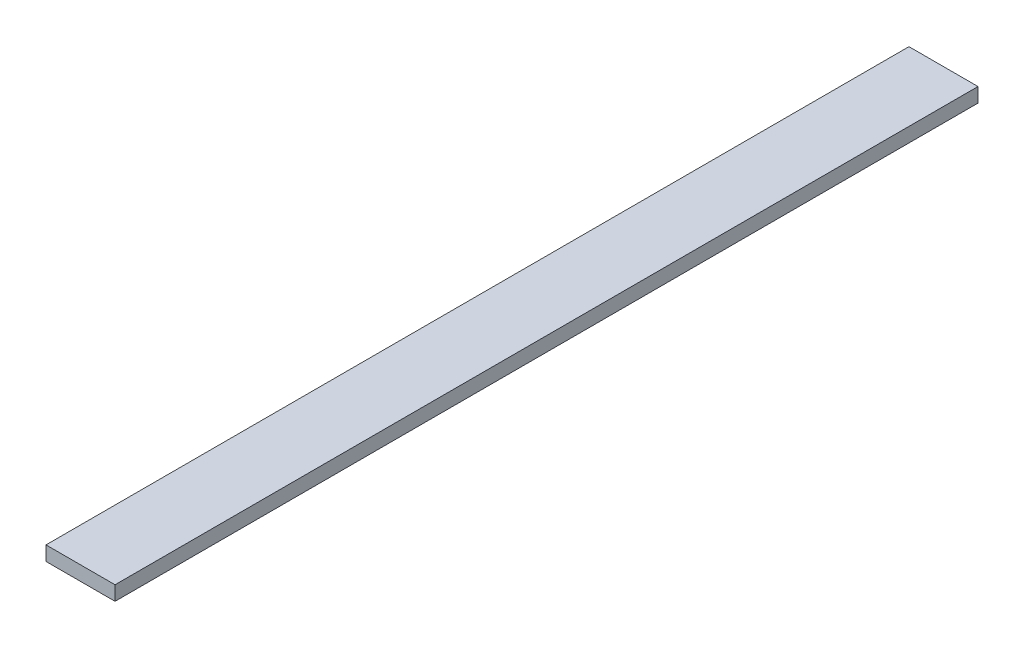
ISO-10303-21;
HEADER;
FILE_DESCRIPTION(('STEP AP214'),'2;1');
FILE_NAME('part.step','',(''),(''),'','','');
FILE_SCHEMA(('AUTOMOTIVE_DESIGN { 1 0 10303 214 1 1 1 1 }'));
ENDSEC;
DATA;
#1=APPLICATION_CONTEXT('core data for automotive mechanical design processes');
#2=APPLICATION_PROTOCOL_DEFINITION('international standard','automotive_design',2000,#1);
#3=PRODUCT_CONTEXT('',#1,'mechanical');
#4=PRODUCT('Part','Part','',(#3));
#5=PRODUCT_RELATED_PRODUCT_CATEGORY('part','',(#4));
#6=PRODUCT_DEFINITION_FORMATION('','',#4);
#7=PRODUCT_DEFINITION_CONTEXT('part definition',#1,'design');
#8=PRODUCT_DEFINITION('design','',#6,#7);
#9=PRODUCT_DEFINITION_SHAPE('','',#8);
#10=(LENGTH_UNIT() NAMED_UNIT(*) SI_UNIT(.MILLI.,.METRE.));
#11=(NAMED_UNIT(*) PLANE_ANGLE_UNIT() SI_UNIT($,.RADIAN.));
#12=(NAMED_UNIT(*) SI_UNIT($,.STERADIAN.) SOLID_ANGLE_UNIT());
#13=UNCERTAINTY_MEASURE_WITH_UNIT(LENGTH_MEASURE(1.E-05),#10,'distance_accuracy_value','');
#14=(GEOMETRIC_REPRESENTATION_CONTEXT(3) GLOBAL_UNCERTAINTY_ASSIGNED_CONTEXT((#13)) GLOBAL_UNIT_ASSIGNED_CONTEXT((#10,
#11,#12)) REPRESENTATION_CONTEXT('',''));
#15=CARTESIAN_POINT('',(0.,0.,0.));
#16=DIRECTION('',(0.,0.,1.));
#17=DIRECTION('',(1.,0.,0.));
#18=AXIS2_PLACEMENT_3D('',#15,#16,#17);
#19=CARTESIAN_POINT('',(24.,5.,0.));
#20=DIRECTION('',(0.,1.,0.));
#21=DIRECTION('',(0.,0.,1.));
#22=AXIS2_PLACEMENT_3D('',#19,#20,#21);
#23=PLANE('',#22);
#24=DIRECTION('',(1.,0.,0.));
#25=VECTOR('',#24,1.);
#26=CARTESIAN_POINT('',(0.,5.,600.));
#27=LINE('',#26,#25);
#28=CARTESIAN_POINT('',(24.,5.,600.));
#29=VERTEX_POINT('',#28);
#30=CARTESIAN_POINT('',(-24.,5.,600.));
#31=VERTEX_POINT('',#30);
#32=EDGE_CURVE('E55',#29,#31,#27,.F.);
#33=ORIENTED_EDGE('',*,*,#32,.F.);
#34=DIRECTION('',(0.,0.,-1.));
#35=VECTOR('',#34,1.);
#36=CARTESIAN_POINT('',(24.,5.,0.));
#37=LINE('',#36,#35);
#38=CARTESIAN_POINT('',(24.,5.,0.));
#39=VERTEX_POINT('',#38);
#40=EDGE_CURVE('E67',#39,#29,#37,.F.);
#41=ORIENTED_EDGE('',*,*,#40,.F.);
#42=DIRECTION('',(1.,0.,0.));
#43=VECTOR('',#42,1.);
#44=CARTESIAN_POINT('',(0.,5.,0.));
#45=LINE('',#44,#43);
#46=CARTESIAN_POINT('',(-24.,5.,0.));
#47=VERTEX_POINT('',#46);
#48=EDGE_CURVE('E20',#39,#47,#45,.F.);
#49=ORIENTED_EDGE('',*,*,#48,.T.);
#50=DIRECTION('',(0.,0.,1.));
#51=VECTOR('',#50,1.);
#52=CARTESIAN_POINT('',(-24.,5.,0.));
#53=LINE('',#52,#51);
#54=EDGE_CURVE('E81',#31,#47,#53,.F.);
#55=ORIENTED_EDGE('',*,*,#54,.F.);
#56=EDGE_LOOP('',(#33,#41,#49,#55));
#57=FACE_BOUND('',#56,.T.);
#58=ADVANCED_FACE('F17',(#57),#23,.T.);
#59=CARTESIAN_POINT('',(0.,0.,0.));
#60=DIRECTION('',(0.,0.,1.));
#61=DIRECTION('',(1.,0.,0.));
#62=AXIS2_PLACEMENT_3D('',#59,#60,#61);
#63=PLANE('',#62);
#64=DIRECTION('',(0.,1.,0.));
#65=VECTOR('',#64,1.);
#66=CARTESIAN_POINT('',(24.,-5.,0.));
#67=LINE('',#66,#65);
#68=CARTESIAN_POINT('',(24.,-5.,0.));
#69=VERTEX_POINT('',#68);
#70=EDGE_CURVE('E62',#69,#39,#67,.T.);
#71=ORIENTED_EDGE('',*,*,#70,.F.);
#72=DIRECTION('',(1.,0.,0.));
#73=VECTOR('',#72,1.);
#74=CARTESIAN_POINT('',(-24.,-5.,0.));
#75=LINE('',#74,#73);
#76=CARTESIAN_POINT('',(-24.,-5.,0.));
#77=VERTEX_POINT('',#76);
#78=EDGE_CURVE('E83',#77,#69,#75,.T.);
#79=ORIENTED_EDGE('',*,*,#78,.F.);
#80=DIRECTION('',(0.,1.,0.));
#81=VECTOR('',#80,1.);
#82=CARTESIAN_POINT('',(-24.,5.,0.));
#83=LINE('',#82,#81);
#84=EDGE_CURVE('E65',#47,#77,#83,.F.);
#85=ORIENTED_EDGE('',*,*,#84,.F.);
#86=ORIENTED_EDGE('',*,*,#48,.F.);
#87=EDGE_LOOP('',(#71,#79,#85,#86));
#88=FACE_BOUND('',#87,.T.);
#89=ADVANCED_FACE('F60',(#88),#63,.F.);
#90=CARTESIAN_POINT('',(24.,-5.,0.));
#91=DIRECTION('',(1.,0.,0.));
#92=DIRECTION('',(0.,0.,-1.));
#93=AXIS2_PLACEMENT_3D('',#90,#91,#92);
#94=PLANE('',#93);
#95=DIRECTION('',(0.,1.,0.));
#96=VECTOR('',#95,1.);
#97=CARTESIAN_POINT('',(24.,0.,600.));
#98=LINE('',#97,#96);
#99=CARTESIAN_POINT('',(24.,-5.,600.));
#100=VERTEX_POINT('',#99);
#101=EDGE_CURVE('E77',#100,#29,#98,.T.);
#102=ORIENTED_EDGE('',*,*,#101,.F.);
#103=DIRECTION('',(0.,0.,1.));
#104=VECTOR('',#103,1.);
#105=CARTESIAN_POINT('',(24.,-5.,0.));
#106=LINE('',#105,#104);
#107=EDGE_CURVE('E73',#69,#100,#106,.T.);
#108=ORIENTED_EDGE('',*,*,#107,.F.);
#109=ORIENTED_EDGE('',*,*,#70,.T.);
#110=ORIENTED_EDGE('',*,*,#40,.T.);
#111=EDGE_LOOP('',(#102,#108,#109,#110));
#112=FACE_BOUND('',#111,.T.);
#113=ADVANCED_FACE('F71',(#112),#94,.T.);
#114=CARTESIAN_POINT('',(0.,0.,600.));
#115=DIRECTION('',(0.,0.,1.));
#116=DIRECTION('',(1.,0.,0.));
#117=AXIS2_PLACEMENT_3D('',#114,#115,#116);
#118=PLANE('',#117);
#119=DIRECTION('',(1.,0.,0.));
#120=VECTOR('',#119,1.);
#121=CARTESIAN_POINT('',(-24.,-5.,600.));
#122=LINE('',#121,#120);
#123=CARTESIAN_POINT('',(-24.,-5.,600.));
#124=VERTEX_POINT('',#123);
#125=EDGE_CURVE('E26',#100,#124,#122,.F.);
#126=ORIENTED_EDGE('',*,*,#125,.F.);
#127=ORIENTED_EDGE('',*,*,#101,.T.);
#128=ORIENTED_EDGE('',*,*,#32,.T.);
#129=DIRECTION('',(0.,1.,0.));
#130=VECTOR('',#129,1.);
#131=CARTESIAN_POINT('',(-24.,5.,600.));
#132=LINE('',#131,#130);
#133=EDGE_CURVE('E35',#124,#31,#132,.T.);
#134=ORIENTED_EDGE('',*,*,#133,.F.);
#135=EDGE_LOOP('',(#126,#127,#128,#134));
#136=FACE_BOUND('',#135,.T.);
#137=ADVANCED_FACE('F89',(#136),#118,.T.);
#138=CARTESIAN_POINT('',(-24.,5.,0.));
#139=DIRECTION('',(-1.,0.,0.));
#140=DIRECTION('',(0.,0.,1.));
#141=AXIS2_PLACEMENT_3D('',#138,#139,#140);
#142=PLANE('',#141);
#143=ORIENTED_EDGE('',*,*,#133,.T.);
#144=ORIENTED_EDGE('',*,*,#54,.T.);
#145=ORIENTED_EDGE('',*,*,#84,.T.);
#146=DIRECTION('',(0.,0.,1.));
#147=VECTOR('',#146,1.);
#148=CARTESIAN_POINT('',(-24.,-5.,0.));
#149=LINE('',#148,#147);
#150=EDGE_CURVE('E11',#124,#77,#149,.F.);
#151=ORIENTED_EDGE('',*,*,#150,.F.);
#152=EDGE_LOOP('',(#143,#144,#145,#151));
#153=FACE_BOUND('',#152,.T.);
#154=ADVANCED_FACE('F91',(#153),#142,.T.);
#155=CARTESIAN_POINT('',(-24.,-5.,0.));
#156=DIRECTION('',(0.,-1.,0.));
#157=DIRECTION('',(1.,0.,0.));
#158=AXIS2_PLACEMENT_3D('',#155,#156,#157);
#159=PLANE('',#158);
#160=ORIENTED_EDGE('',*,*,#125,.T.);
#161=ORIENTED_EDGE('',*,*,#150,.T.);
#162=ORIENTED_EDGE('',*,*,#78,.T.);
#163=ORIENTED_EDGE('',*,*,#107,.T.);
#164=EDGE_LOOP('',(#160,#161,#162,#163));
#165=FACE_BOUND('',#164,.T.);
#166=ADVANCED_FACE('F88',(#165),#159,.T.);
#167=CLOSED_SHELL('',(#58,#89,#113,#137,#154,#166));
#168=MANIFOLD_SOLID_BREP('B1',#167);
#169=ADVANCED_BREP_SHAPE_REPRESENTATION('',(#18,#168),#14);
#170=SHAPE_DEFINITION_REPRESENTATION(#9,#169);
ENDSEC;
END-ISO-10303-21;
